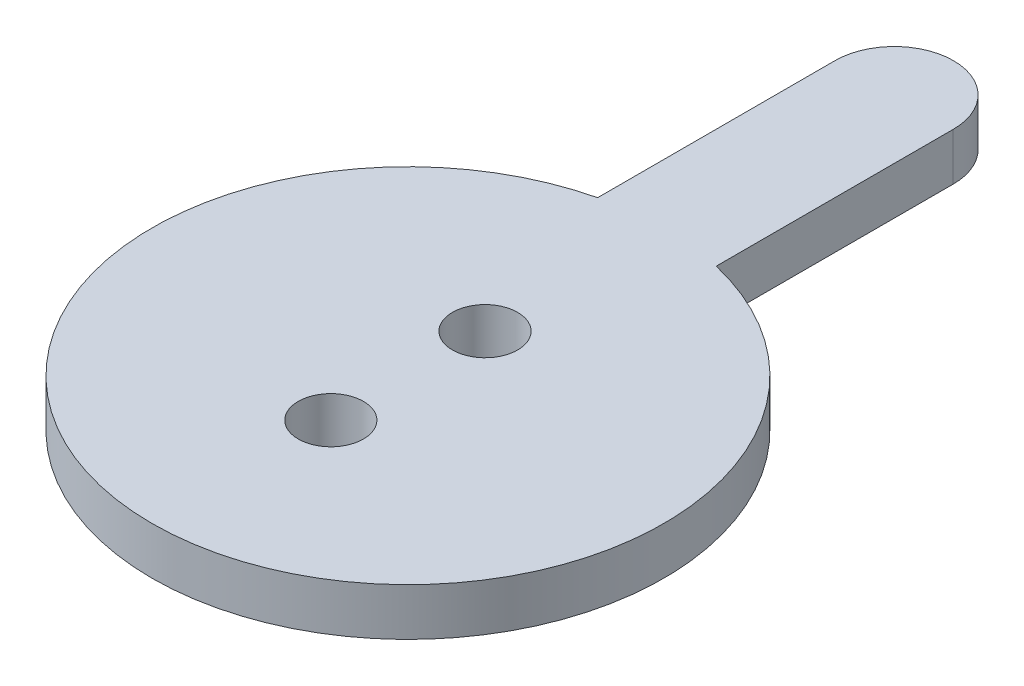
ISO-10303-21;
HEADER;
FILE_DESCRIPTION(('STEP AP214'),'2;1');
FILE_NAME('part.step','',(''),(''),'','','');
FILE_SCHEMA(('AUTOMOTIVE_DESIGN { 1 0 10303 214 1 1 1 1 }'));
ENDSEC;
DATA;
#1=APPLICATION_CONTEXT('core data for automotive mechanical design processes');
#2=APPLICATION_PROTOCOL_DEFINITION('international standard','automotive_design',2000,#1);
#3=PRODUCT_CONTEXT('',#1,'mechanical');
#4=PRODUCT('Part','Part','',(#3));
#5=PRODUCT_RELATED_PRODUCT_CATEGORY('part','',(#4));
#6=PRODUCT_DEFINITION_FORMATION('','',#4);
#7=PRODUCT_DEFINITION_CONTEXT('part definition',#1,'design');
#8=PRODUCT_DEFINITION('design','',#6,#7);
#9=PRODUCT_DEFINITION_SHAPE('','',#8);
#10=(LENGTH_UNIT() NAMED_UNIT(*) SI_UNIT(.MILLI.,.METRE.));
#11=(NAMED_UNIT(*) PLANE_ANGLE_UNIT() SI_UNIT($,.RADIAN.));
#12=(NAMED_UNIT(*) SI_UNIT($,.STERADIAN.) SOLID_ANGLE_UNIT());
#13=UNCERTAINTY_MEASURE_WITH_UNIT(LENGTH_MEASURE(1.E-05),#10,'distance_accuracy_value','');
#14=(GEOMETRIC_REPRESENTATION_CONTEXT(3) GLOBAL_UNCERTAINTY_ASSIGNED_CONTEXT((#13)) GLOBAL_UNIT_ASSIGNED_CONTEXT((#10,
#11,#12)) REPRESENTATION_CONTEXT('',''));
#15=CARTESIAN_POINT('',(0.,0.,0.));
#16=DIRECTION('',(0.,0.,1.));
#17=DIRECTION('',(1.,0.,0.));
#18=AXIS2_PLACEMENT_3D('',#15,#16,#17);
#19=CARTESIAN_POINT('',(-4.99999999999999,4.,0.));
#20=DIRECTION('',(1.,0.,0.));
#21=DIRECTION('',(0.,0.,-1.));
#22=AXIS2_PLACEMENT_3D('',#19,#20,#21);
#23=PLANE('',#22);
#24=DIRECTION('',(0.,0.,1.));
#25=VECTOR('',#24,1.);
#26=CARTESIAN_POINT('',(-4.99999999999999,0.,0.));
#27=LINE('',#26,#25);
#28=CARTESIAN_POINT('',(-5.,0.,-40.9937300046924));
#29=VERTEX_POINT('',#28);
#30=CARTESIAN_POINT('',(-5.,0.,-20.9937300046924));
#31=VERTEX_POINT('',#30);
#32=EDGE_CURVE('E109',#29,#31,#27,.T.);
#33=ORIENTED_EDGE('',*,*,#32,.T.);
#34=DIRECTION('',(0.,-1.,0.));
#35=VECTOR('',#34,1.);
#36=CARTESIAN_POINT('',(-5.,4.,-20.9937300046924));
#37=LINE('',#36,#35);
#38=CARTESIAN_POINT('',(-5.,4.,-20.9937300046924));
#39=VERTEX_POINT('',#38);
#40=EDGE_CURVE('E11',#39,#31,#37,.T.);
#41=ORIENTED_EDGE('',*,*,#40,.F.);
#42=DIRECTION('',(0.,0.,1.));
#43=VECTOR('',#42,1.);
#44=CARTESIAN_POINT('',(-4.99999999999999,4.,0.));
#45=LINE('',#44,#43);
#46=CARTESIAN_POINT('',(-5.,4.,-40.9937300046924));
#47=VERTEX_POINT('',#46);
#48=EDGE_CURVE('E89',#47,#39,#45,.T.);
#49=ORIENTED_EDGE('',*,*,#48,.F.);
#50=DIRECTION('',(0.,-1.,0.));
#51=VECTOR('',#50,1.);
#52=CARTESIAN_POINT('',(-5.,4.,-40.9937300046924));
#53=LINE('',#52,#51);
#54=EDGE_CURVE('E55',#47,#29,#53,.T.);
#55=ORIENTED_EDGE('',*,*,#54,.T.);
#56=EDGE_LOOP('',(#33,#41,#49,#55));
#57=FACE_BOUND('',#56,.T.);
#58=ADVANCED_FACE('F39',(#57),#23,.F.);
#59=CARTESIAN_POINT('',(0.,4.,0.));
#60=DIRECTION('',(0.,-1.,0.));
#61=DIRECTION('',(0.,0.,-1.));
#62=AXIS2_PLACEMENT_3D('',#59,#60,#61);
#63=CYLINDRICAL_SURFACE('',#62,21.5809337033855);
#64=CARTESIAN_POINT('',(0.,0.,0.));
#65=DIRECTION('',(0.,1.,0.));
#66=DIRECTION('',(0.,0.,1.));
#67=AXIS2_PLACEMENT_3D('',#64,#65,#66);
#68=CIRCLE('',#67,21.5809337033855);
#69=CARTESIAN_POINT('',(4.99963070305278,0.,-20.9938179553652));
#70=VERTEX_POINT('',#69);
#71=EDGE_CURVE('E94',#31,#70,#68,.T.);
#72=ORIENTED_EDGE('',*,*,#71,.T.);
#73=DIRECTION('',(0.,-1.,0.));
#74=VECTOR('',#73,1.);
#75=CARTESIAN_POINT('',(4.99963070305278,4.,-20.9938179553652));
#76=LINE('',#75,#74);
#77=CARTESIAN_POINT('',(4.99963070305278,4.,-20.9938179553652));
#78=VERTEX_POINT('',#77);
#79=EDGE_CURVE('E47',#78,#70,#76,.T.);
#80=ORIENTED_EDGE('',*,*,#79,.F.);
#81=CARTESIAN_POINT('',(0.,4.,0.));
#82=DIRECTION('',(0.,1.,0.));
#83=DIRECTION('',(0.,0.,1.));
#84=AXIS2_PLACEMENT_3D('',#81,#82,#83);
#85=CIRCLE('',#84,21.5809337033855);
#86=EDGE_CURVE('E81',#39,#78,#85,.T.);
#87=ORIENTED_EDGE('',*,*,#86,.F.);
#88=ORIENTED_EDGE('',*,*,#40,.T.);
#89=EDGE_LOOP('',(#72,#80,#87,#88));
#90=FACE_BOUND('',#89,.T.);
#91=ADVANCED_FACE('F93',(#90),#63,.T.);
#92=CARTESIAN_POINT('',(4.99963070305278,4.,0.));
#93=DIRECTION('',(-1.,0.,0.));
#94=DIRECTION('',(0.,0.,1.));
#95=AXIS2_PLACEMENT_3D('',#92,#93,#94);
#96=PLANE('',#95);
#97=DIRECTION('',(0.,0.,-1.));
#98=VECTOR('',#97,1.);
#99=CARTESIAN_POINT('',(4.99963070305278,0.,0.));
#100=LINE('',#99,#98);
#101=CARTESIAN_POINT('',(4.99963070305278,0.,-40.9389087082054));
#102=VERTEX_POINT('',#101);
#103=EDGE_CURVE('E112',#70,#102,#100,.T.);
#104=ORIENTED_EDGE('',*,*,#103,.T.);
#105=DIRECTION('',(0.,-1.,0.));
#106=VECTOR('',#105,1.);
#107=CARTESIAN_POINT('',(4.99963070305278,4.,-40.9389087082054));
#108=LINE('',#107,#106);
#109=CARTESIAN_POINT('',(4.99963070305278,4.,-40.9389087082054));
#110=VERTEX_POINT('',#109);
#111=EDGE_CURVE('E70',#110,#102,#108,.T.);
#112=ORIENTED_EDGE('',*,*,#111,.F.);
#113=DIRECTION('',(0.,0.,-1.));
#114=VECTOR('',#113,1.);
#115=CARTESIAN_POINT('',(4.99963070305278,4.,0.));
#116=LINE('',#115,#114);
#117=EDGE_CURVE('E88',#78,#110,#116,.T.);
#118=ORIENTED_EDGE('',*,*,#117,.F.);
#119=ORIENTED_EDGE('',*,*,#79,.T.);
#120=EDGE_LOOP('',(#104,#112,#118,#119));
#121=FACE_BOUND('',#120,.T.);
#122=ADVANCED_FACE('F97',(#121),#96,.F.);
#123=CARTESIAN_POINT('',(0.,4.,6.5));
#124=DIRECTION('',(0.,-1.,0.));
#125=DIRECTION('',(0.,0.,-1.));
#126=AXIS2_PLACEMENT_3D('',#123,#124,#125);
#127=CYLINDRICAL_SURFACE('',#126,2.75);
#128=CARTESIAN_POINT('',(0.,4.,6.5));
#129=DIRECTION('',(0.,1.,0.));
#130=DIRECTION('',(0.,0.,1.));
#131=AXIS2_PLACEMENT_3D('',#128,#129,#130);
#132=CIRCLE('',#131,2.75);
#133=CARTESIAN_POINT('',(0.,4.,9.25));
#134=VERTEX_POINT('',#133);
#135=EDGE_CURVE('E100',#134,#134,#132,.T.);
#136=ORIENTED_EDGE('',*,*,#135,.T.);
#137=EDGE_LOOP('',(#136));
#138=FACE_BOUND('',#137,.T.);
#139=CARTESIAN_POINT('',(0.,0.,6.5));
#140=DIRECTION('',(0.,1.,0.));
#141=DIRECTION('',(0.,0.,1.));
#142=AXIS2_PLACEMENT_3D('',#139,#140,#141);
#143=CIRCLE('',#142,2.75);
#144=CARTESIAN_POINT('',(0.,0.,9.25));
#145=VERTEX_POINT('',#144);
#146=EDGE_CURVE('E117',#145,#145,#143,.T.);
#147=ORIENTED_EDGE('',*,*,#146,.F.);
#148=EDGE_LOOP('',(#147));
#149=FACE_BOUND('',#148,.T.);
#150=ADVANCED_FACE('F138',(#138,#149),#127,.F.);
#151=CARTESIAN_POINT('',(0.,4.,-41.));
#152=DIRECTION('',(0.,-1.,0.));
#153=DIRECTION('',(0.,0.,-1.));
#154=AXIS2_PLACEMENT_3D('',#151,#152,#153);
#155=CYLINDRICAL_SURFACE('',#154,5.00000393128257);
#156=CARTESIAN_POINT('',(0.,0.,-41.));
#157=DIRECTION('',(0.,1.,0.));
#158=DIRECTION('',(0.,0.,1.));
#159=AXIS2_PLACEMENT_3D('',#156,#157,#158);
#160=CIRCLE('',#159,5.00000393128257);
#161=EDGE_CURVE('E114',#29,#102,#160,.F.);
#162=ORIENTED_EDGE('',*,*,#161,.F.);
#163=ORIENTED_EDGE('',*,*,#54,.F.);
#164=CARTESIAN_POINT('',(0.,4.,-41.));
#165=DIRECTION('',(0.,1.,0.));
#166=DIRECTION('',(0.,0.,1.));
#167=AXIS2_PLACEMENT_3D('',#164,#165,#166);
#168=CIRCLE('',#167,5.00000393128257);
#169=EDGE_CURVE('E98',#47,#110,#168,.F.);
#170=ORIENTED_EDGE('',*,*,#169,.T.);
#171=ORIENTED_EDGE('',*,*,#111,.T.);
#172=EDGE_LOOP('',(#162,#163,#170,#171));
#173=FACE_BOUND('',#172,.T.);
#174=ADVANCED_FACE('F130',(#173),#155,.T.);
#175=CARTESIAN_POINT('',(0.,4.,-6.5));
#176=DIRECTION('',(0.,-1.,0.));
#177=DIRECTION('',(0.,0.,-1.));
#178=AXIS2_PLACEMENT_3D('',#175,#176,#177);
#179=CYLINDRICAL_SURFACE('',#178,2.75);
#180=CARTESIAN_POINT('',(0.,4.,-6.5));
#181=DIRECTION('',(0.,1.,0.));
#182=DIRECTION('',(0.,0.,1.));
#183=AXIS2_PLACEMENT_3D('',#180,#181,#182);
#184=CIRCLE('',#183,2.75);
#185=CARTESIAN_POINT('',(0.,4.,-3.75));
#186=VERTEX_POINT('',#185);
#187=EDGE_CURVE('E106',#186,#186,#184,.T.);
#188=ORIENTED_EDGE('',*,*,#187,.T.);
#189=EDGE_LOOP('',(#188));
#190=FACE_BOUND('',#189,.T.);
#191=CARTESIAN_POINT('',(0.,0.,-6.5));
#192=DIRECTION('',(0.,1.,0.));
#193=DIRECTION('',(0.,0.,1.));
#194=AXIS2_PLACEMENT_3D('',#191,#192,#193);
#195=CIRCLE('',#194,2.75);
#196=CARTESIAN_POINT('',(0.,0.,-3.75));
#197=VERTEX_POINT('',#196);
#198=EDGE_CURVE('E120',#197,#197,#195,.T.);
#199=ORIENTED_EDGE('',*,*,#198,.F.);
#200=EDGE_LOOP('',(#199));
#201=FACE_BOUND('',#200,.T.);
#202=ADVANCED_FACE('F128',(#190,#201),#179,.F.);
#203=CARTESIAN_POINT('',(0.,4.,0.));
#204=DIRECTION('',(0.,1.,0.));
#205=DIRECTION('',(0.,0.,1.));
#206=AXIS2_PLACEMENT_3D('',#203,#204,#205);
#207=PLANE('',#206);
#208=ORIENTED_EDGE('',*,*,#48,.T.);
#209=ORIENTED_EDGE('',*,*,#86,.T.);
#210=ORIENTED_EDGE('',*,*,#117,.T.);
#211=ORIENTED_EDGE('',*,*,#169,.F.);
#212=EDGE_LOOP('',(#208,#209,#210,#211));
#213=FACE_BOUND('',#212,.T.);
#214=ORIENTED_EDGE('',*,*,#135,.F.);
#215=EDGE_LOOP('',(#214));
#216=FACE_BOUND('',#215,.T.);
#217=ORIENTED_EDGE('',*,*,#187,.F.);
#218=EDGE_LOOP('',(#217));
#219=FACE_BOUND('',#218,.T.);
#220=ADVANCED_FACE('F84',(#213,#216,#219),#207,.T.);
#221=CARTESIAN_POINT('',(0.,0.,0.));
#222=DIRECTION('',(0.,1.,0.));
#223=DIRECTION('',(0.,0.,1.));
#224=AXIS2_PLACEMENT_3D('',#221,#222,#223);
#225=PLANE('',#224);
#226=ORIENTED_EDGE('',*,*,#32,.F.);
#227=ORIENTED_EDGE('',*,*,#161,.T.);
#228=ORIENTED_EDGE('',*,*,#103,.F.);
#229=ORIENTED_EDGE('',*,*,#71,.F.);
#230=EDGE_LOOP('',(#226,#227,#228,#229));
#231=FACE_BOUND('',#230,.T.);
#232=ORIENTED_EDGE('',*,*,#146,.T.);
#233=EDGE_LOOP('',(#232));
#234=FACE_BOUND('',#233,.T.);
#235=ORIENTED_EDGE('',*,*,#198,.T.);
#236=EDGE_LOOP('',(#235));
#237=FACE_BOUND('',#236,.T.);
#238=ADVANCED_FACE('F126',(#231,#234,#237),#225,.F.);
#239=CLOSED_SHELL('',(#58,#91,#122,#150,#174,#202,#220,#238));
#240=MANIFOLD_SOLID_BREP('B2',#239);
#241=ADVANCED_BREP_SHAPE_REPRESENTATION('',(#18,#240),#14);
#242=SHAPE_DEFINITION_REPRESENTATION(#9,#241);
ENDSEC;
END-ISO-10303-21;
